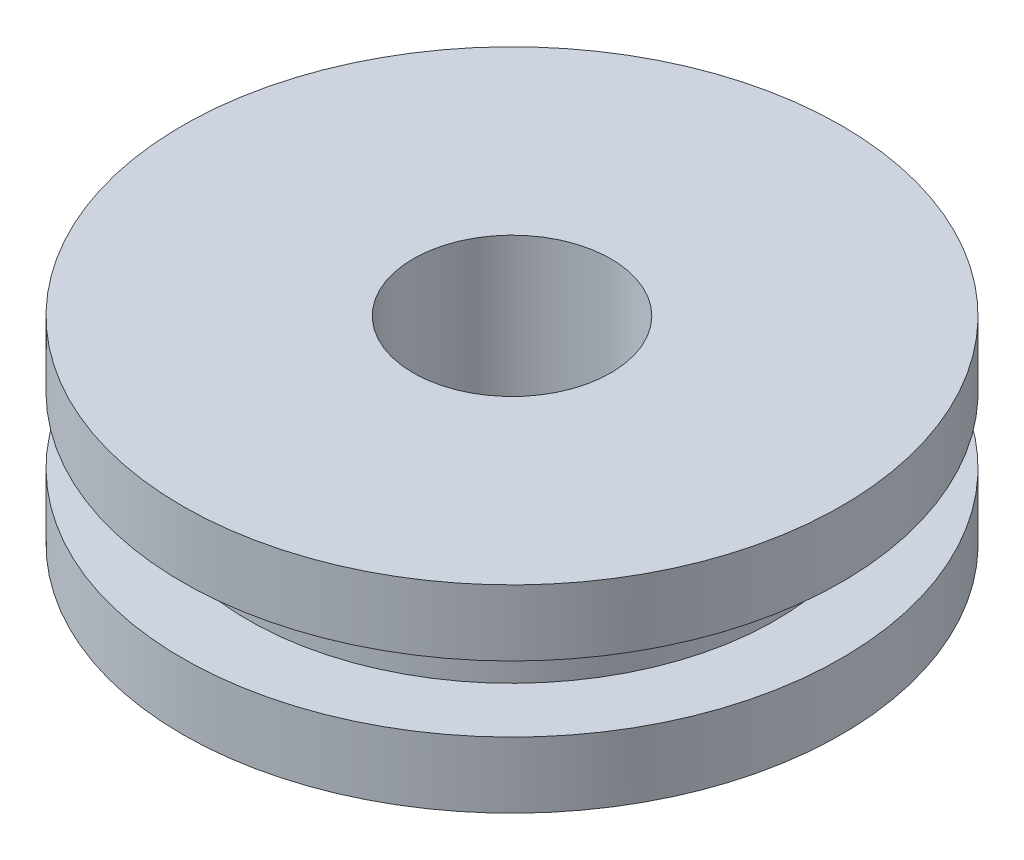
ISO-10303-21;
HEADER;
FILE_DESCRIPTION(('STEP AP214'),'2;1');
FILE_NAME('part.step','',(''),(''),'','','');
FILE_SCHEMA(('AUTOMOTIVE_DESIGN { 1 0 10303 214 1 1 1 1 }'));
ENDSEC;
DATA;
#1=APPLICATION_CONTEXT('core data for automotive mechanical design processes');
#2=APPLICATION_PROTOCOL_DEFINITION('international standard','automotive_design',2000,#1);
#3=PRODUCT_CONTEXT('',#1,'mechanical');
#4=PRODUCT('Part','Part','',(#3));
#5=PRODUCT_RELATED_PRODUCT_CATEGORY('part','',(#4));
#6=PRODUCT_DEFINITION_FORMATION('','',#4);
#7=PRODUCT_DEFINITION_CONTEXT('part definition',#1,'design');
#8=PRODUCT_DEFINITION('design','',#6,#7);
#9=PRODUCT_DEFINITION_SHAPE('','',#8);
#10=(LENGTH_UNIT() NAMED_UNIT(*) SI_UNIT(.MILLI.,.METRE.));
#11=(NAMED_UNIT(*) PLANE_ANGLE_UNIT() SI_UNIT($,.RADIAN.));
#12=(NAMED_UNIT(*) SI_UNIT($,.STERADIAN.) SOLID_ANGLE_UNIT());
#13=UNCERTAINTY_MEASURE_WITH_UNIT(LENGTH_MEASURE(1.E-05),#10,'distance_accuracy_value','');
#14=(GEOMETRIC_REPRESENTATION_CONTEXT(3) GLOBAL_UNCERTAINTY_ASSIGNED_CONTEXT((#13)) GLOBAL_UNIT_ASSIGNED_CONTEXT((#10,
#11,#12)) REPRESENTATION_CONTEXT('',''));
#15=CARTESIAN_POINT('',(0.,0.,0.));
#16=DIRECTION('',(0.,0.,1.));
#17=DIRECTION('',(1.,0.,0.));
#18=AXIS2_PLACEMENT_3D('',#15,#16,#17);
#19=CARTESIAN_POINT('',(0.,3.,0.));
#20=DIRECTION('',(0.,-1.,0.));
#21=DIRECTION('',(0.,0.,-1.));
#22=AXIS2_PLACEMENT_3D('',#19,#20,#21);
#23=CYLINDRICAL_SURFACE('',#22,5.);
#24=CARTESIAN_POINT('',(0.,3.,0.));
#25=DIRECTION('',(0.,1.,0.));
#26=DIRECTION('',(0.,0.,1.));
#27=AXIS2_PLACEMENT_3D('',#24,#25,#26);
#28=CIRCLE('',#27,5.);
#29=CARTESIAN_POINT('',(0.,3.,5.));
#30=VERTEX_POINT('',#29);
#31=EDGE_CURVE('E11',#30,#30,#28,.T.);
#32=ORIENTED_EDGE('',*,*,#31,.F.);
#33=EDGE_LOOP('',(#32));
#34=FACE_BOUND('',#33,.T.);
#35=CARTESIAN_POINT('',(0.,2.,0.));
#36=DIRECTION('',(0.,-1.,0.));
#37=DIRECTION('',(0.,0.,-1.));
#38=AXIS2_PLACEMENT_3D('',#35,#36,#37);
#39=CIRCLE('',#38,5.);
#40=CARTESIAN_POINT('',(0.,2.,-5.));
#41=VERTEX_POINT('',#40);
#42=EDGE_CURVE('E57',#41,#41,#39,.T.);
#43=ORIENTED_EDGE('',*,*,#42,.F.);
#44=EDGE_LOOP('',(#43));
#45=FACE_BOUND('',#44,.T.);
#46=ADVANCED_FACE('F40',(#34,#45),#23,.T.);
#47=CARTESIAN_POINT('',(0.,1.,0.));
#48=DIRECTION('',(0.,-1.,0.));
#49=DIRECTION('',(0.,0.,-1.));
#50=AXIS2_PLACEMENT_3D('',#47,#48,#49);
#51=CIRCLE('',#50,5.);
#52=CARTESIAN_POINT('',(0.,1.,-5.));
#53=VERTEX_POINT('',#52);
#54=EDGE_CURVE('E58',#53,#53,#51,.T.);
#55=ORIENTED_EDGE('',*,*,#54,.T.);
#56=EDGE_LOOP('',(#55));
#57=FACE_BOUND('',#56,.T.);
#58=CARTESIAN_POINT('',(0.,0.,0.));
#59=DIRECTION('',(0.,1.,0.));
#60=DIRECTION('',(0.,0.,1.));
#61=AXIS2_PLACEMENT_3D('',#58,#59,#60);
#62=CIRCLE('',#61,5.);
#63=CARTESIAN_POINT('',(0.,0.,5.));
#64=VERTEX_POINT('',#63);
#65=EDGE_CURVE('E48',#64,#64,#62,.T.);
#66=ORIENTED_EDGE('',*,*,#65,.T.);
#67=EDGE_LOOP('',(#66));
#68=FACE_BOUND('',#67,.T.);
#69=ADVANCED_FACE('F42',(#57,#68),#23,.T.);
#70=CARTESIAN_POINT('',(0.,3.,0.));
#71=DIRECTION('',(0.,1.,0.));
#72=DIRECTION('',(0.,0.,1.));
#73=AXIS2_PLACEMENT_3D('',#70,#71,#72);
#74=PLANE('',#73);
#75=CARTESIAN_POINT('',(0.,3.,0.));
#76=DIRECTION('',(0.,1.,0.));
#77=DIRECTION('',(0.,0.,1.));
#78=AXIS2_PLACEMENT_3D('',#75,#76,#77);
#79=CIRCLE('',#78,1.5);
#80=CARTESIAN_POINT('',(0.,3.,1.5));
#81=VERTEX_POINT('',#80);
#82=EDGE_CURVE('E54',#81,#81,#79,.T.);
#83=ORIENTED_EDGE('',*,*,#82,.F.);
#84=EDGE_LOOP('',(#83));
#85=FACE_BOUND('',#84,.T.);
#86=ORIENTED_EDGE('',*,*,#31,.T.);
#87=EDGE_LOOP('',(#86));
#88=FACE_BOUND('',#87,.T.);
#89=ADVANCED_FACE('F86',(#85,#88),#74,.T.);
#90=CARTESIAN_POINT('',(0.,0.,0.));
#91=DIRECTION('',(0.,1.,0.));
#92=DIRECTION('',(0.,0.,1.));
#93=AXIS2_PLACEMENT_3D('',#90,#91,#92);
#94=PLANE('',#93);
#95=CARTESIAN_POINT('',(0.,0.,0.));
#96=DIRECTION('',(0.,1.,0.));
#97=DIRECTION('',(0.,0.,1.));
#98=AXIS2_PLACEMENT_3D('',#95,#96,#97);
#99=CIRCLE('',#98,1.5);
#100=CARTESIAN_POINT('',(0.,0.,1.5));
#101=VERTEX_POINT('',#100);
#102=EDGE_CURVE('E44',#101,#101,#99,.T.);
#103=ORIENTED_EDGE('',*,*,#102,.T.);
#104=EDGE_LOOP('',(#103));
#105=FACE_BOUND('',#104,.T.);
#106=ORIENTED_EDGE('',*,*,#65,.F.);
#107=EDGE_LOOP('',(#106));
#108=FACE_BOUND('',#107,.T.);
#109=ADVANCED_FACE('F91',(#105,#108),#94,.F.);
#110=CARTESIAN_POINT('',(0.,-8.,0.));
#111=DIRECTION('',(0.,1.,0.));
#112=DIRECTION('',(0.,0.,1.));
#113=AXIS2_PLACEMENT_3D('',#110,#111,#112);
#114=CYLINDRICAL_SURFACE('',#113,1.5);
#115=ORIENTED_EDGE('',*,*,#82,.T.);
#116=EDGE_LOOP('',(#115));
#117=FACE_BOUND('',#116,.T.);
#118=ORIENTED_EDGE('',*,*,#102,.F.);
#119=EDGE_LOOP('',(#118));
#120=FACE_BOUND('',#119,.T.);
#121=ADVANCED_FACE('F77',(#117,#120),#114,.F.);
#122=CARTESIAN_POINT('',(0.,2.,0.));
#123=DIRECTION('',(0.,-1.,0.));
#124=DIRECTION('',(0.,0.,-1.));
#125=AXIS2_PLACEMENT_3D('',#122,#123,#124);
#126=PLANE('',#125);
#127=CARTESIAN_POINT('',(0.,2.,0.));
#128=DIRECTION('',(0.,-1.,0.));
#129=DIRECTION('',(0.,0.,-1.));
#130=AXIS2_PLACEMENT_3D('',#127,#128,#129);
#131=CIRCLE('',#130,4.);
#132=CARTESIAN_POINT('',(0.,2.,-4.));
#133=VERTEX_POINT('',#132);
#134=EDGE_CURVE('E61',#133,#133,#131,.T.);
#135=ORIENTED_EDGE('',*,*,#134,.F.);
#136=EDGE_LOOP('',(#135));
#137=FACE_BOUND('',#136,.T.);
#138=ORIENTED_EDGE('',*,*,#42,.T.);
#139=EDGE_LOOP('',(#138));
#140=FACE_BOUND('',#139,.T.);
#141=ADVANCED_FACE('F73',(#137,#140),#126,.T.);
#142=CARTESIAN_POINT('',(0.,1.,0.));
#143=DIRECTION('',(0.,-1.,0.));
#144=DIRECTION('',(0.,0.,-1.));
#145=AXIS2_PLACEMENT_3D('',#142,#143,#144);
#146=PLANE('',#145);
#147=CARTESIAN_POINT('',(0.,1.,0.));
#148=DIRECTION('',(0.,-1.,0.));
#149=DIRECTION('',(0.,0.,-1.));
#150=AXIS2_PLACEMENT_3D('',#147,#148,#149);
#151=CIRCLE('',#150,4.);
#152=CARTESIAN_POINT('',(0.,1.,-4.));
#153=VERTEX_POINT('',#152);
#154=EDGE_CURVE('E64',#153,#153,#151,.T.);
#155=ORIENTED_EDGE('',*,*,#154,.T.);
#156=EDGE_LOOP('',(#155));
#157=FACE_BOUND('',#156,.T.);
#158=ORIENTED_EDGE('',*,*,#54,.F.);
#159=EDGE_LOOP('',(#158));
#160=FACE_BOUND('',#159,.T.);
#161=ADVANCED_FACE('F76',(#157,#160),#146,.F.);
#162=CARTESIAN_POINT('',(0.,2.,0.));
#163=DIRECTION('',(0.,-1.,0.));
#164=DIRECTION('',(0.,0.,-1.));
#165=AXIS2_PLACEMENT_3D('',#162,#163,#164);
#166=CYLINDRICAL_SURFACE('',#165,4.);
#167=ORIENTED_EDGE('',*,*,#134,.T.);
#168=EDGE_LOOP('',(#167));
#169=FACE_BOUND('',#168,.T.);
#170=ORIENTED_EDGE('',*,*,#154,.F.);
#171=EDGE_LOOP('',(#170));
#172=FACE_BOUND('',#171,.T.);
#173=ADVANCED_FACE('F70',(#169,#172),#166,.T.);
#174=CLOSED_SHELL('',(#46,#69,#89,#109,#121,#141,#161,#173));
#175=MANIFOLD_SOLID_BREP('B2',#174);
#176=ADVANCED_BREP_SHAPE_REPRESENTATION('',(#18,#175),#14);
#177=SHAPE_DEFINITION_REPRESENTATION(#9,#176);
ENDSEC;
END-ISO-10303-21;
